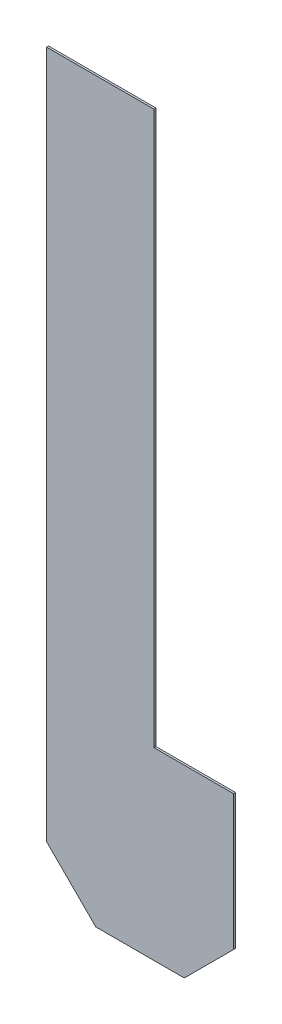
ISO-10303-21;
HEADER;
FILE_DESCRIPTION(('STEP AP214'),'2;1');
FILE_NAME('part.step','',(''),(''),'','','');
FILE_SCHEMA(('AUTOMOTIVE_DESIGN { 1 0 10303 214 1 1 1 1 }'));
ENDSEC;
DATA;
#1=APPLICATION_CONTEXT('core data for automotive mechanical design processes');
#2=APPLICATION_PROTOCOL_DEFINITION('international standard','automotive_design',2000,#1);
#3=PRODUCT_CONTEXT('',#1,'mechanical');
#4=PRODUCT('Part','Part','',(#3));
#5=PRODUCT_RELATED_PRODUCT_CATEGORY('part','',(#4));
#6=PRODUCT_DEFINITION_FORMATION('','',#4);
#7=PRODUCT_DEFINITION_CONTEXT('part definition',#1,'design');
#8=PRODUCT_DEFINITION('design','',#6,#7);
#9=PRODUCT_DEFINITION_SHAPE('','',#8);
#10=(LENGTH_UNIT() NAMED_UNIT(*) SI_UNIT(.MILLI.,.METRE.));
#11=(NAMED_UNIT(*) PLANE_ANGLE_UNIT() SI_UNIT($,.RADIAN.));
#12=(NAMED_UNIT(*) SI_UNIT($,.STERADIAN.) SOLID_ANGLE_UNIT());
#13=UNCERTAINTY_MEASURE_WITH_UNIT(LENGTH_MEASURE(1.E-05),#10,'distance_accuracy_value','');
#14=(GEOMETRIC_REPRESENTATION_CONTEXT(3) GLOBAL_UNCERTAINTY_ASSIGNED_CONTEXT((#13)) GLOBAL_UNIT_ASSIGNED_CONTEXT((#10,
#11,#12)) REPRESENTATION_CONTEXT('',''));
#15=CARTESIAN_POINT('',(0.,0.,0.));
#16=DIRECTION('',(0.,0.,1.));
#17=DIRECTION('',(1.,0.,0.));
#18=AXIS2_PLACEMENT_3D('',#15,#16,#17);
#19=CARTESIAN_POINT('',(5.01719624398298,-6.83452873404173,-16.2814000000013));
#20=DIRECTION('',(0.,0.,1.));
#21=DIRECTION('',(1.,0.,0.));
#22=AXIS2_PLACEMENT_3D('',#19,#20,#21);
#23=PLANE('',#22);
#24=DIRECTION('',(0.,1.,0.));
#25=VECTOR('',#24,1.);
#26=CARTESIAN_POINT('',(3.23663073452813,3.00213201513404,-16.2814000000013));
#27=LINE('',#26,#25);
#28=CARTESIAN_POINT('',(3.23663073452813,3.00213201513405,-16.2814000000013));
#29=VERTEX_POINT('',#28);
#30=CARTESIAN_POINT('',(3.23663073452813,-14.777867984866,-16.2814000000013));
#31=VERTEX_POINT('',#30);
#32=EDGE_CURVE('E20',#29,#31,#27,.F.);
#33=ORIENTED_EDGE('',*,*,#32,.F.);
#34=DIRECTION('',(-1.,0.,0.));
#35=VECTOR('',#34,1.);
#36=CARTESIAN_POINT('',(6.01475573452813,3.00213201513406,-16.2814000000013));
#37=LINE('',#36,#35);
#38=CARTESIAN_POINT('',(6.01475573452812,3.00213201513404,-16.2814000000013));
#39=VERTEX_POINT('',#38);
#40=EDGE_CURVE('E83',#39,#29,#37,.T.);
#41=ORIENTED_EDGE('',*,*,#40,.F.);
#42=DIRECTION('',(0.,1.,0.));
#43=VECTOR('',#42,1.);
#44=CARTESIAN_POINT('',(6.01475573452811,-11.2853679848659,-16.2814000000013));
#45=LINE('',#44,#43);
#46=CARTESIAN_POINT('',(6.01475573452811,-11.2853679848659,-16.2814000000013));
#47=VERTEX_POINT('',#46);
#48=EDGE_CURVE('E78',#47,#39,#45,.T.);
#49=ORIENTED_EDGE('',*,*,#48,.F.);
#50=DIRECTION('',(-1.,0.,0.));
#51=VECTOR('',#50,1.);
#52=CARTESIAN_POINT('',(8.06263073452811,-11.2853679848659,-16.2814000000013));
#53=LINE('',#52,#51);
#54=CARTESIAN_POINT('',(8.06263073452811,-11.2853679848659,-16.2814000000013));
#55=VERTEX_POINT('',#54);
#56=EDGE_CURVE('E105',#55,#47,#53,.T.);
#57=ORIENTED_EDGE('',*,*,#56,.F.);
#58=DIRECTION('',(0.,1.,0.));
#59=VECTOR('',#58,1.);
#60=CARTESIAN_POINT('',(8.06263073452811,-14.7778679848659,-16.2814000000013));
#61=LINE('',#60,#59);
#62=CARTESIAN_POINT('',(8.06263073452811,-14.7778679848659,-16.2814000000013));
#63=VERTEX_POINT('',#62);
#64=EDGE_CURVE('E109',#63,#55,#61,.T.);
#65=ORIENTED_EDGE('',*,*,#64,.F.);
#66=DIRECTION('',(0.707106781186548,0.707106781186547,0.));
#67=VECTOR('',#66,1.);
#68=CARTESIAN_POINT('',(6.79263073452812,-16.0478679848659,-16.2814000000013));
#69=LINE('',#68,#67);
#70=CARTESIAN_POINT('',(6.79263073452812,-16.0478679848659,-16.2814000000013));
#71=VERTEX_POINT('',#70);
#72=EDGE_CURVE('E113',#71,#63,#69,.T.);
#73=ORIENTED_EDGE('',*,*,#72,.F.);
#74=DIRECTION('',(1.,0.,0.));
#75=VECTOR('',#74,1.);
#76=CARTESIAN_POINT('',(4.50663073452812,-16.0478679848659,-16.2814000000013));
#77=LINE('',#76,#75);
#78=CARTESIAN_POINT('',(4.50663073452811,-16.0478679848659,-16.2814000000013));
#79=VERTEX_POINT('',#78);
#80=EDGE_CURVE('E117',#79,#71,#77,.T.);
#81=ORIENTED_EDGE('',*,*,#80,.F.);
#82=DIRECTION('',(0.707106781186548,-0.707106781186548,0.));
#83=VECTOR('',#82,1.);
#84=CARTESIAN_POINT('',(3.23663073452812,-14.777867984866,-16.2814000000012));
#85=LINE('',#84,#83);
#86=EDGE_CURVE('E94',#31,#79,#85,.T.);
#87=ORIENTED_EDGE('',*,*,#86,.F.);
#88=EDGE_LOOP('',(#33,#41,#49,#57,#65,#73,#81,#87));
#89=FACE_BOUND('',#88,.T.);
#90=ADVANCED_FACE('F17',(#89),#23,.F.);
#91=CARTESIAN_POINT('',(3.23663073452813,3.00213201513404,-16.2306000000012));
#92=DIRECTION('',(-1.,0.,0.));
#93=DIRECTION('',(0.,0.,1.));
#94=AXIS2_PLACEMENT_3D('',#91,#92,#93);
#95=PLANE('',#94);
#96=DIRECTION('',(0.,1.,0.));
#97=VECTOR('',#96,1.);
#98=CARTESIAN_POINT('',(3.23663073452812,2.06621600756764,-16.2306000000026));
#99=LINE('',#98,#97);
#100=CARTESIAN_POINT('',(3.23663073452813,-14.777867984866,-16.2306000000016));
#101=VERTEX_POINT('',#100);
#102=CARTESIAN_POINT('',(3.23663073452813,3.00213201513405,-16.2306000000016));
#103=VERTEX_POINT('',#102);
#104=EDGE_CURVE('E100',#101,#103,#99,.T.);
#105=ORIENTED_EDGE('',*,*,#104,.T.);
#106=DIRECTION('',(0.,0.,1.));
#107=VECTOR('',#106,1.);
#108=CARTESIAN_POINT('',(3.23663073452813,3.00213201513406,-16.2306000000013));
#109=LINE('',#108,#107);
#110=EDGE_CURVE('E88',#29,#103,#109,.T.);
#111=ORIENTED_EDGE('',*,*,#110,.F.);
#112=ORIENTED_EDGE('',*,*,#32,.T.);
#113=DIRECTION('',(0.,0.,1.));
#114=VECTOR('',#113,1.);
#115=CARTESIAN_POINT('',(3.23663073452812,-14.777867984866,-16.2306000000012));
#116=LINE('',#115,#114);
#117=EDGE_CURVE('E123',#101,#31,#116,.F.);
#118=ORIENTED_EDGE('',*,*,#117,.F.);
#119=EDGE_LOOP('',(#105,#111,#112,#118));
#120=FACE_BOUND('',#119,.T.);
#121=ADVANCED_FACE('F99',(#120),#95,.T.);
#122=CARTESIAN_POINT('',(6.01475573452813,3.00213201513406,-16.2306000000013));
#123=DIRECTION('',(0.,1.,0.));
#124=DIRECTION('',(-1.,0.,0.));
#125=AXIS2_PLACEMENT_3D('',#122,#123,#124);
#126=PLANE('',#125);
#127=DIRECTION('',(-1.,0.,0.));
#128=VECTOR('',#127,1.);
#129=CARTESIAN_POINT('',(-2.66453525910038E-13,3.00213201513404,-16.2306000000026));
#130=LINE('',#129,#128);
#131=CARTESIAN_POINT('',(6.01475573452812,3.00213201513405,-16.2306000000016));
#132=VERTEX_POINT('',#131);
#133=EDGE_CURVE('E126',#103,#132,#130,.F.);
#134=ORIENTED_EDGE('',*,*,#133,.T.);
#135=DIRECTION('',(0.,0.,-1.));
#136=VECTOR('',#135,1.);
#137=CARTESIAN_POINT('',(6.01475573452811,3.00213201513404,-16.2306000000013));
#138=LINE('',#137,#136);
#139=EDGE_CURVE('E90',#39,#132,#138,.F.);
#140=ORIENTED_EDGE('',*,*,#139,.F.);
#141=ORIENTED_EDGE('',*,*,#40,.T.);
#142=ORIENTED_EDGE('',*,*,#110,.T.);
#143=EDGE_LOOP('',(#134,#140,#141,#142));
#144=FACE_BOUND('',#143,.T.);
#145=ADVANCED_FACE('F86',(#144),#126,.T.);
#146=CARTESIAN_POINT('',(6.01475573452811,-11.2853679848659,-16.2306000000013));
#147=DIRECTION('',(1.,0.,0.));
#148=DIRECTION('',(0.,0.,-1.));
#149=AXIS2_PLACEMENT_3D('',#146,#147,#148);
#150=PLANE('',#149);
#151=DIRECTION('',(0.,1.,0.));
#152=VECTOR('',#151,1.);
#153=CARTESIAN_POINT('',(6.01475573452813,2.06621600756764,-16.2306000000026));
#154=LINE('',#153,#152);
#155=CARTESIAN_POINT('',(6.01475573452812,-11.2853679848659,-16.2306000000016));
#156=VERTEX_POINT('',#155);
#157=EDGE_CURVE('E128',#132,#156,#154,.F.);
#158=ORIENTED_EDGE('',*,*,#157,.T.);
#159=DIRECTION('',(0.,0.,1.));
#160=VECTOR('',#159,1.);
#161=CARTESIAN_POINT('',(6.01475573452811,-11.2853679848659,-16.2306000000013));
#162=LINE('',#161,#160);
#163=EDGE_CURVE('E107',#47,#156,#162,.T.);
#164=ORIENTED_EDGE('',*,*,#163,.F.);
#165=ORIENTED_EDGE('',*,*,#48,.T.);
#166=ORIENTED_EDGE('',*,*,#139,.T.);
#167=EDGE_LOOP('',(#158,#164,#165,#166));
#168=FACE_BOUND('',#167,.T.);
#169=ADVANCED_FACE('F162',(#168),#150,.T.);
#170=CARTESIAN_POINT('',(8.06263073452811,-11.2853679848659,-16.2306000000013));
#171=DIRECTION('',(0.,1.,0.));
#172=DIRECTION('',(-1.,0.,0.));
#173=AXIS2_PLACEMENT_3D('',#170,#171,#172);
#174=PLANE('',#173);
#175=DIRECTION('',(-1.,0.,0.));
#176=VECTOR('',#175,1.);
#177=CARTESIAN_POINT('',(-2.66453525910038E-13,-11.2853679848659,-16.2306000000026));
#178=LINE('',#177,#176);
#179=CARTESIAN_POINT('',(8.06263073452811,-11.2853679848659,-16.2306000000016));
#180=VERTEX_POINT('',#179);
#181=EDGE_CURVE('E131',#156,#180,#178,.F.);
#182=ORIENTED_EDGE('',*,*,#181,.T.);
#183=DIRECTION('',(0.,0.,-1.));
#184=VECTOR('',#183,1.);
#185=CARTESIAN_POINT('',(8.06263073452811,-11.2853679848659,-16.2306000000012));
#186=LINE('',#185,#184);
#187=EDGE_CURVE('E111',#55,#180,#186,.F.);
#188=ORIENTED_EDGE('',*,*,#187,.F.);
#189=ORIENTED_EDGE('',*,*,#56,.T.);
#190=ORIENTED_EDGE('',*,*,#163,.T.);
#191=EDGE_LOOP('',(#182,#188,#189,#190));
#192=FACE_BOUND('',#191,.T.);
#193=ADVANCED_FACE('F161',(#192),#174,.T.);
#194=CARTESIAN_POINT('',(8.06263073452811,-14.7778679848659,-16.2306000000012));
#195=DIRECTION('',(1.,0.,0.));
#196=DIRECTION('',(0.,0.,-1.));
#197=AXIS2_PLACEMENT_3D('',#194,#195,#196);
#198=PLANE('',#197);
#199=DIRECTION('',(0.,1.,0.));
#200=VECTOR('',#199,1.);
#201=CARTESIAN_POINT('',(8.06263073452811,2.06621600756764,-16.2306000000026));
#202=LINE('',#201,#200);
#203=CARTESIAN_POINT('',(8.06263073452811,-14.7778679848659,-16.2306000000016));
#204=VERTEX_POINT('',#203);
#205=EDGE_CURVE('E134',#180,#204,#202,.F.);
#206=ORIENTED_EDGE('',*,*,#205,.T.);
#207=DIRECTION('',(0.,0.,1.));
#208=VECTOR('',#207,1.);
#209=CARTESIAN_POINT('',(8.06263073452812,-14.7778679848659,-16.2306000000013));
#210=LINE('',#209,#208);
#211=EDGE_CURVE('E115',#63,#204,#210,.T.);
#212=ORIENTED_EDGE('',*,*,#211,.F.);
#213=ORIENTED_EDGE('',*,*,#64,.T.);
#214=ORIENTED_EDGE('',*,*,#187,.T.);
#215=EDGE_LOOP('',(#206,#212,#213,#214));
#216=FACE_BOUND('',#215,.T.);
#217=ADVANCED_FACE('F155',(#216),#198,.T.);
#218=CARTESIAN_POINT('',(6.79263073452812,-16.0478679848659,-16.2306000000013));
#219=DIRECTION('',(0.707106781186547,-0.707106781186548,0.));
#220=DIRECTION('',(0.707106781186548,0.707106781186547,0.));
#221=AXIS2_PLACEMENT_3D('',#218,#219,#220);
#222=PLANE('',#221);
#223=DIRECTION('',(-0.707106781186545,-0.70710678118655,0.));
#224=VECTOR('',#223,1.);
#225=CARTESIAN_POINT('',(8.06263073452811,-14.7778679848659,-16.2306000000026));
#226=LINE('',#225,#224);
#227=CARTESIAN_POINT('',(6.79263073452812,-16.0478679848659,-16.2306000000016));
#228=VERTEX_POINT('',#227);
#229=EDGE_CURVE('E137',#204,#228,#226,.T.);
#230=ORIENTED_EDGE('',*,*,#229,.T.);
#231=DIRECTION('',(0.,0.,1.));
#232=VECTOR('',#231,1.);
#233=CARTESIAN_POINT('',(6.79263073452812,-16.0478679848659,-16.2306000000013));
#234=LINE('',#233,#232);
#235=EDGE_CURVE('E119',#71,#228,#234,.T.);
#236=ORIENTED_EDGE('',*,*,#235,.F.);
#237=ORIENTED_EDGE('',*,*,#72,.T.);
#238=ORIENTED_EDGE('',*,*,#211,.T.);
#239=EDGE_LOOP('',(#230,#236,#237,#238));
#240=FACE_BOUND('',#239,.T.);
#241=ADVANCED_FACE('F150',(#240),#222,.T.);
#242=CARTESIAN_POINT('',(4.50663073452812,-16.0478679848659,-16.2306000000013));
#243=DIRECTION('',(0.,-1.,0.));
#244=DIRECTION('',(1.,0.,0.));
#245=AXIS2_PLACEMENT_3D('',#242,#243,#244);
#246=PLANE('',#245);
#247=DIRECTION('',(-1.,0.,0.));
#248=VECTOR('',#247,1.);
#249=CARTESIAN_POINT('',(-2.66453525910038E-13,-16.0478679848659,-16.2306000000026));
#250=LINE('',#249,#248);
#251=CARTESIAN_POINT('',(4.50663073452811,-16.0478679848659,-16.2306000000016));
#252=VERTEX_POINT('',#251);
#253=EDGE_CURVE('E26',#228,#252,#250,.T.);
#254=ORIENTED_EDGE('',*,*,#253,.T.);
#255=DIRECTION('',(0.,0.,1.));
#256=VECTOR('',#255,1.);
#257=CARTESIAN_POINT('',(4.50663073452807,-16.0478679848659,-16.2306000000012));
#258=LINE('',#257,#256);
#259=EDGE_CURVE('E34',#79,#252,#258,.T.);
#260=ORIENTED_EDGE('',*,*,#259,.F.);
#261=ORIENTED_EDGE('',*,*,#80,.T.);
#262=ORIENTED_EDGE('',*,*,#235,.T.);
#263=EDGE_LOOP('',(#254,#260,#261,#262));
#264=FACE_BOUND('',#263,.T.);
#265=ADVANCED_FACE('F143',(#264),#246,.T.);
#266=CARTESIAN_POINT('',(3.23663073452812,-14.777867984866,-16.2306000000012));
#267=DIRECTION('',(-0.707106781186548,-0.707106781186548,0.));
#268=DIRECTION('',(0.707106781186548,-0.707106781186548,0.));
#269=AXIS2_PLACEMENT_3D('',#266,#267,#268);
#270=PLANE('',#269);
#271=DIRECTION('',(-0.707106781186575,0.70710678118652,0.));
#272=VECTOR('',#271,1.);
#273=CARTESIAN_POINT('',(4.50663073452812,-16.0478679848659,-16.2306000000026));
#274=LINE('',#273,#272);
#275=EDGE_CURVE('E11',#252,#101,#274,.T.);
#276=ORIENTED_EDGE('',*,*,#275,.T.);
#277=ORIENTED_EDGE('',*,*,#117,.T.);
#278=ORIENTED_EDGE('',*,*,#86,.T.);
#279=ORIENTED_EDGE('',*,*,#259,.T.);
#280=EDGE_LOOP('',(#276,#277,#278,#279));
#281=FACE_BOUND('',#280,.T.);
#282=ADVANCED_FACE('F163',(#281),#270,.T.);
#283=CARTESIAN_POINT('',(-2.66453525910038E-13,2.06621600756764,-16.2306000000026));
#284=DIRECTION('',(0.,0.,-1.));
#285=DIRECTION('',(-1.,0.,0.));
#286=AXIS2_PLACEMENT_3D('',#283,#284,#285);
#287=PLANE('',#286);
#288=ORIENTED_EDGE('',*,*,#253,.F.);
#289=ORIENTED_EDGE('',*,*,#229,.F.);
#290=ORIENTED_EDGE('',*,*,#205,.F.);
#291=ORIENTED_EDGE('',*,*,#181,.F.);
#292=ORIENTED_EDGE('',*,*,#157,.F.);
#293=ORIENTED_EDGE('',*,*,#133,.F.);
#294=ORIENTED_EDGE('',*,*,#104,.F.);
#295=ORIENTED_EDGE('',*,*,#275,.F.);
#296=EDGE_LOOP('',(#288,#289,#290,#291,#292,#293,#294,#295));
#297=FACE_BOUND('',#296,.T.);
#298=ADVANCED_FACE('F147',(#297),#287,.F.);
#299=CLOSED_SHELL('',(#90,#121,#145,#169,#193,#217,#241,#265,#282,#298));
#300=MANIFOLD_SOLID_BREP('B1',#299);
#301=ADVANCED_BREP_SHAPE_REPRESENTATION('',(#18,#300),#14);
#302=SHAPE_DEFINITION_REPRESENTATION(#9,#301);
ENDSEC;
END-ISO-10303-21;
